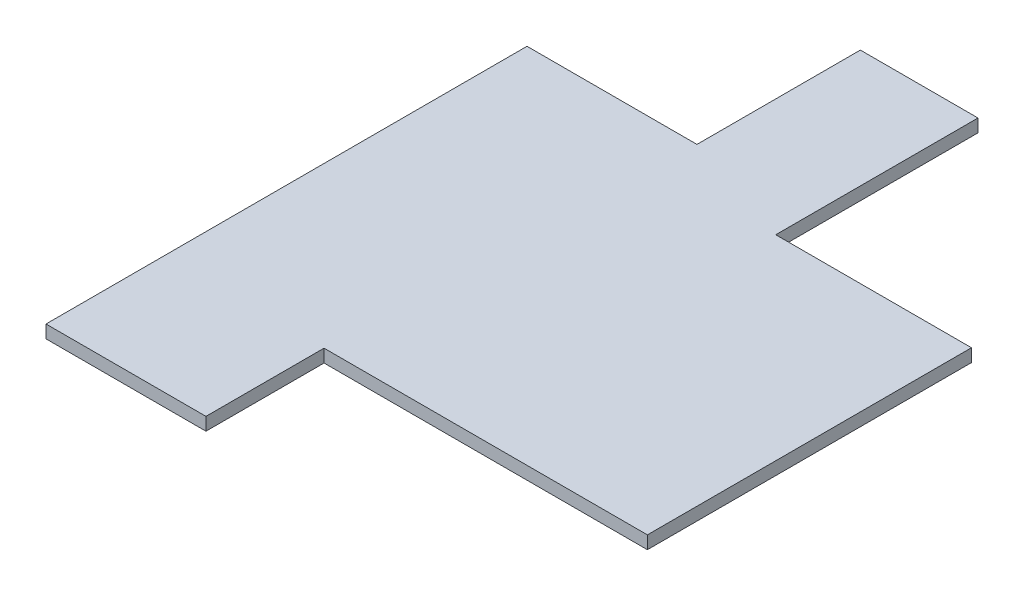
ISO-10303-21;
HEADER;
FILE_DESCRIPTION(('STEP AP214'),'2;1');
FILE_NAME('part.step','',(''),(''),'','','');
FILE_SCHEMA(('AUTOMOTIVE_DESIGN { 1 0 10303 214 1 1 1 1 }'));
ENDSEC;
DATA;
#1=APPLICATION_CONTEXT('core data for automotive mechanical design processes');
#2=APPLICATION_PROTOCOL_DEFINITION('international standard','automotive_design',2000,#1);
#3=PRODUCT_CONTEXT('',#1,'mechanical');
#4=PRODUCT('Part','Part','',(#3));
#5=PRODUCT_RELATED_PRODUCT_CATEGORY('part','',(#4));
#6=PRODUCT_DEFINITION_FORMATION('','',#4);
#7=PRODUCT_DEFINITION_CONTEXT('part definition',#1,'design');
#8=PRODUCT_DEFINITION('design','',#6,#7);
#9=PRODUCT_DEFINITION_SHAPE('','',#8);
#10=(LENGTH_UNIT() NAMED_UNIT(*) SI_UNIT(.MILLI.,.METRE.));
#11=(NAMED_UNIT(*) PLANE_ANGLE_UNIT() SI_UNIT($,.RADIAN.));
#12=(NAMED_UNIT(*) SI_UNIT($,.STERADIAN.) SOLID_ANGLE_UNIT());
#13=UNCERTAINTY_MEASURE_WITH_UNIT(LENGTH_MEASURE(1.E-05),#10,'distance_accuracy_value','');
#14=(GEOMETRIC_REPRESENTATION_CONTEXT(3) GLOBAL_UNCERTAINTY_ASSIGNED_CONTEXT((#13)) GLOBAL_UNIT_ASSIGNED_CONTEXT((#10,
#11,#12)) REPRESENTATION_CONTEXT('',''));
#15=CARTESIAN_POINT('',(0.,0.,0.));
#16=DIRECTION('',(0.,0.,1.));
#17=DIRECTION('',(1.,0.,0.));
#18=AXIS2_PLACEMENT_3D('',#15,#16,#17);
#19=CARTESIAN_POINT('',(-15.,0.4,20.));
#20=DIRECTION('',(1.,0.,0.));
#21=DIRECTION('',(0.,0.,-1.));
#22=AXIS2_PLACEMENT_3D('',#19,#20,#21);
#23=PLANE('',#22);
#24=DIRECTION('',(0.,0.,1.));
#25=VECTOR('',#24,1.);
#26=CARTESIAN_POINT('',(-15.,-0.4,20.));
#27=LINE('',#26,#25);
#28=CARTESIAN_POINT('',(-15.,-0.4,-9.85814327363708));
#29=VERTEX_POINT('',#28);
#30=CARTESIAN_POINT('',(-15.,-0.4,20.));
#31=VERTEX_POINT('',#30);
#32=EDGE_CURVE('E144',#29,#31,#27,.T.);
#33=ORIENTED_EDGE('',*,*,#32,.T.);
#34=DIRECTION('',(0.,-1.,0.));
#35=VECTOR('',#34,1.);
#36=CARTESIAN_POINT('',(-15.,0.4,20.));
#37=LINE('',#36,#35);
#38=CARTESIAN_POINT('',(-15.,0.4,20.));
#39=VERTEX_POINT('',#38);
#40=EDGE_CURVE('E11',#39,#31,#37,.T.);
#41=ORIENTED_EDGE('',*,*,#40,.F.);
#42=DIRECTION('',(0.,0.,1.));
#43=VECTOR('',#42,1.);
#44=CARTESIAN_POINT('',(-15.,0.4,20.));
#45=LINE('',#44,#43);
#46=CARTESIAN_POINT('',(-15.,0.4,-9.85814327363708));
#47=VERTEX_POINT('',#46);
#48=EDGE_CURVE('E162',#47,#39,#45,.T.);
#49=ORIENTED_EDGE('',*,*,#48,.F.);
#50=DIRECTION('',(0.,-1.,0.));
#51=VECTOR('',#50,1.);
#52=CARTESIAN_POINT('',(-15.,0.4,-9.85814327363708));
#53=LINE('',#52,#51);
#54=EDGE_CURVE('E140',#47,#29,#53,.T.);
#55=ORIENTED_EDGE('',*,*,#54,.T.);
#56=EDGE_LOOP('',(#33,#41,#49,#55));
#57=FACE_BOUND('',#56,.T.);
#58=ADVANCED_FACE('F36',(#57),#23,.F.);
#59=CARTESIAN_POINT('',(-15.,0.4,20.));
#60=DIRECTION('',(0.,0.,-1.));
#61=DIRECTION('',(-1.,0.,0.));
#62=AXIS2_PLACEMENT_3D('',#59,#60,#61);
#63=PLANE('',#62);
#64=DIRECTION('',(1.,0.,0.));
#65=VECTOR('',#64,1.);
#66=CARTESIAN_POINT('',(-15.,-0.4,20.));
#67=LINE('',#66,#65);
#68=CARTESIAN_POINT('',(-5.07095815207298,-0.4,20.));
#69=VERTEX_POINT('',#68);
#70=EDGE_CURVE('E147',#31,#69,#67,.T.);
#71=ORIENTED_EDGE('',*,*,#70,.T.);
#72=DIRECTION('',(0.,-1.,0.));
#73=VECTOR('',#72,1.);
#74=CARTESIAN_POINT('',(-5.07095815207298,0.4,20.));
#75=LINE('',#74,#73);
#76=CARTESIAN_POINT('',(-5.07095815207298,0.4,20.));
#77=VERTEX_POINT('',#76);
#78=EDGE_CURVE('E44',#77,#69,#75,.T.);
#79=ORIENTED_EDGE('',*,*,#78,.F.);
#80=DIRECTION('',(1.,0.,0.));
#81=VECTOR('',#80,1.);
#82=CARTESIAN_POINT('',(-15.,0.4,20.));
#83=LINE('',#82,#81);
#84=EDGE_CURVE('E101',#39,#77,#83,.T.);
#85=ORIENTED_EDGE('',*,*,#84,.F.);
#86=ORIENTED_EDGE('',*,*,#40,.T.);
#87=EDGE_LOOP('',(#71,#79,#85,#86));
#88=FACE_BOUND('',#87,.T.);
#89=ADVANCED_FACE('F211',(#88),#63,.F.);
#90=CARTESIAN_POINT('',(-5.07095815207298,0.4,20.));
#91=DIRECTION('',(-1.,0.,0.));
#92=DIRECTION('',(0.,0.,1.));
#93=AXIS2_PLACEMENT_3D('',#90,#91,#92);
#94=PLANE('',#93);
#95=DIRECTION('',(0.,0.,-1.));
#96=VECTOR('',#95,1.);
#97=CARTESIAN_POINT('',(-5.07095815207298,-0.4,20.));
#98=LINE('',#97,#96);
#99=CARTESIAN_POINT('',(-5.07095815207298,-0.4,12.6697448093642));
#100=VERTEX_POINT('',#99);
#101=EDGE_CURVE('E149',#69,#100,#98,.T.);
#102=ORIENTED_EDGE('',*,*,#101,.T.);
#103=DIRECTION('',(0.,-1.,0.));
#104=VECTOR('',#103,1.);
#105=CARTESIAN_POINT('',(-5.07095815207298,0.4,12.6697448093642));
#106=LINE('',#105,#104);
#107=CARTESIAN_POINT('',(-5.07095815207298,0.4,12.6697448093642));
#108=VERTEX_POINT('',#107);
#109=EDGE_CURVE('E175',#108,#100,#106,.T.);
#110=ORIENTED_EDGE('',*,*,#109,.F.);
#111=DIRECTION('',(0.,0.,-1.));
#112=VECTOR('',#111,1.);
#113=CARTESIAN_POINT('',(-5.07095815207298,0.4,20.));
#114=LINE('',#113,#112);
#115=EDGE_CURVE('E183',#77,#108,#114,.T.);
#116=ORIENTED_EDGE('',*,*,#115,.F.);
#117=ORIENTED_EDGE('',*,*,#78,.T.);
#118=EDGE_LOOP('',(#102,#110,#116,#117));
#119=FACE_BOUND('',#118,.T.);
#120=ADVANCED_FACE('F181',(#119),#94,.F.);
#121=CARTESIAN_POINT('',(-5.07095815207298,0.4,12.6697448093642));
#122=DIRECTION('',(0.,0.,-1.));
#123=DIRECTION('',(-1.,0.,0.));
#124=AXIS2_PLACEMENT_3D('',#121,#122,#123);
#125=PLANE('',#124);
#126=DIRECTION('',(1.,0.,0.));
#127=VECTOR('',#126,1.);
#128=CARTESIAN_POINT('',(-5.07095815207298,-0.4,12.6697448093642));
#129=LINE('',#128,#127);
#130=CARTESIAN_POINT('',(15.,-0.4,12.6697448093642));
#131=VERTEX_POINT('',#130);
#132=EDGE_CURVE('E151',#100,#131,#129,.T.);
#133=ORIENTED_EDGE('',*,*,#132,.T.);
#134=DIRECTION('',(0.,-1.,0.));
#135=VECTOR('',#134,1.);
#136=CARTESIAN_POINT('',(15.,0.4,12.6697448093642));
#137=LINE('',#136,#135);
#138=CARTESIAN_POINT('',(15.,0.4,12.6697448093642));
#139=VERTEX_POINT('',#138);
#140=EDGE_CURVE('E172',#139,#131,#137,.T.);
#141=ORIENTED_EDGE('',*,*,#140,.F.);
#142=DIRECTION('',(1.,0.,0.));
#143=VECTOR('',#142,1.);
#144=CARTESIAN_POINT('',(-5.07095815207298,0.4,12.6697448093642));
#145=LINE('',#144,#143);
#146=EDGE_CURVE('E201',#108,#139,#145,.T.);
#147=ORIENTED_EDGE('',*,*,#146,.F.);
#148=ORIENTED_EDGE('',*,*,#109,.T.);
#149=EDGE_LOOP('',(#133,#141,#147,#148));
#150=FACE_BOUND('',#149,.T.);
#151=ADVANCED_FACE('F192',(#150),#125,.F.);
#152=CARTESIAN_POINT('',(15.,0.4,12.6697448093642));
#153=DIRECTION('',(-1.,0.,0.));
#154=DIRECTION('',(0.,0.,1.));
#155=AXIS2_PLACEMENT_3D('',#152,#153,#154);
#156=PLANE('',#155);
#157=DIRECTION('',(0.,0.,-1.));
#158=VECTOR('',#157,1.);
#159=CARTESIAN_POINT('',(15.,-0.4,12.6697448093642));
#160=LINE('',#159,#158);
#161=CARTESIAN_POINT('',(15.,-0.4,-7.44690142989077));
#162=VERTEX_POINT('',#161);
#163=EDGE_CURVE('E153',#131,#162,#160,.T.);
#164=ORIENTED_EDGE('',*,*,#163,.T.);
#165=DIRECTION('',(0.,-1.,0.));
#166=VECTOR('',#165,1.);
#167=CARTESIAN_POINT('',(15.,0.4,-7.44690142989077));
#168=LINE('',#167,#166);
#169=CARTESIAN_POINT('',(15.,0.4,-7.44690142989077));
#170=VERTEX_POINT('',#169);
#171=EDGE_CURVE('E169',#170,#162,#168,.T.);
#172=ORIENTED_EDGE('',*,*,#171,.F.);
#173=DIRECTION('',(0.,0.,-1.));
#174=VECTOR('',#173,1.);
#175=CARTESIAN_POINT('',(15.,0.4,12.6697448093642));
#176=LINE('',#175,#174);
#177=EDGE_CURVE('E198',#139,#170,#176,.T.);
#178=ORIENTED_EDGE('',*,*,#177,.F.);
#179=ORIENTED_EDGE('',*,*,#140,.T.);
#180=EDGE_LOOP('',(#164,#172,#178,#179));
#181=FACE_BOUND('',#180,.T.);
#182=ADVANCED_FACE('F196',(#181),#156,.F.);
#183=CARTESIAN_POINT('',(15.,0.4,-7.44690142989077));
#184=DIRECTION('',(0.,0.,1.));
#185=DIRECTION('',(1.,0.,0.));
#186=AXIS2_PLACEMENT_3D('',#183,#184,#185);
#187=PLANE('',#186);
#188=DIRECTION('',(-1.,0.,0.));
#189=VECTOR('',#188,1.);
#190=CARTESIAN_POINT('',(15.,-0.4,-7.44690142989077));
#191=LINE('',#190,#189);
#192=CARTESIAN_POINT('',(2.85169362023634,-0.4,-7.44690142989077));
#193=VERTEX_POINT('',#192);
#194=EDGE_CURVE('E155',#162,#193,#191,.T.);
#195=ORIENTED_EDGE('',*,*,#194,.T.);
#196=DIRECTION('',(0.,-1.,0.));
#197=VECTOR('',#196,1.);
#198=CARTESIAN_POINT('',(2.85169362023634,0.4,-7.44690142989077));
#199=LINE('',#198,#197);
#200=CARTESIAN_POINT('',(2.85169362023634,0.4,-7.44690142989077));
#201=VERTEX_POINT('',#200);
#202=EDGE_CURVE('E166',#201,#193,#199,.T.);
#203=ORIENTED_EDGE('',*,*,#202,.F.);
#204=DIRECTION('',(-1.,0.,0.));
#205=VECTOR('',#204,1.);
#206=CARTESIAN_POINT('',(15.,0.4,-7.44690142989077));
#207=LINE('',#206,#205);
#208=EDGE_CURVE('E200',#170,#201,#207,.T.);
#209=ORIENTED_EDGE('',*,*,#208,.F.);
#210=ORIENTED_EDGE('',*,*,#171,.T.);
#211=EDGE_LOOP('',(#195,#203,#209,#210));
#212=FACE_BOUND('',#211,.T.);
#213=ADVANCED_FACE('F223',(#212),#187,.F.);
#214=CARTESIAN_POINT('',(2.85169362023634,0.4,-7.44690142989077));
#215=DIRECTION('',(-1.,0.,0.));
#216=DIRECTION('',(0.,0.,1.));
#217=AXIS2_PLACEMENT_3D('',#214,#215,#216);
#218=PLANE('',#217);
#219=DIRECTION('',(0.,0.,-1.));
#220=VECTOR('',#219,1.);
#221=CARTESIAN_POINT('',(2.85169362023634,-0.4,-7.44690142989077));
#222=LINE('',#221,#220);
#223=CARTESIAN_POINT('',(2.85169362023634,-0.4,-20.));
#224=VERTEX_POINT('',#223);
#225=EDGE_CURVE('E157',#193,#224,#222,.T.);
#226=ORIENTED_EDGE('',*,*,#225,.T.);
#227=DIRECTION('',(0.,-1.,0.));
#228=VECTOR('',#227,1.);
#229=CARTESIAN_POINT('',(2.85169362023634,0.4,-20.));
#230=LINE('',#229,#228);
#231=CARTESIAN_POINT('',(2.85169362023634,0.4,-20.));
#232=VERTEX_POINT('',#231);
#233=EDGE_CURVE('E135',#232,#224,#230,.T.);
#234=ORIENTED_EDGE('',*,*,#233,.F.);
#235=DIRECTION('',(0.,0.,-1.));
#236=VECTOR('',#235,1.);
#237=CARTESIAN_POINT('',(2.85169362023634,0.4,-7.44690142989077));
#238=LINE('',#237,#236);
#239=EDGE_CURVE('E126',#201,#232,#238,.T.);
#240=ORIENTED_EDGE('',*,*,#239,.F.);
#241=ORIENTED_EDGE('',*,*,#202,.T.);
#242=EDGE_LOOP('',(#226,#234,#240,#241));
#243=FACE_BOUND('',#242,.T.);
#244=ADVANCED_FACE('F226',(#243),#218,.F.);
#245=CARTESIAN_POINT('',(-4.45092453510965,0.4,-20.));
#246=DIRECTION('',(0.,0.,1.));
#247=DIRECTION('',(1.,0.,0.));
#248=AXIS2_PLACEMENT_3D('',#245,#246,#247);
#249=PLANE('',#248);
#250=DIRECTION('',(-1.,0.,0.));
#251=VECTOR('',#250,1.);
#252=CARTESIAN_POINT('',(-4.45092453510965,-0.4,-20.));
#253=LINE('',#252,#251);
#254=CARTESIAN_POINT('',(-4.45092453510965,-0.4,-20.));
#255=VERTEX_POINT('',#254);
#256=EDGE_CURVE('E134',#224,#255,#253,.T.);
#257=ORIENTED_EDGE('',*,*,#256,.T.);
#258=DIRECTION('',(0.,-1.,0.));
#259=VECTOR('',#258,1.);
#260=CARTESIAN_POINT('',(-4.45092453510965,0.4,-20.));
#261=LINE('',#260,#259);
#262=CARTESIAN_POINT('',(-4.45092453510965,0.4,-20.));
#263=VERTEX_POINT('',#262);
#264=EDGE_CURVE('E131',#263,#255,#261,.T.);
#265=ORIENTED_EDGE('',*,*,#264,.F.);
#266=DIRECTION('',(-1.,0.,0.));
#267=VECTOR('',#266,1.);
#268=CARTESIAN_POINT('',(-4.45092453510965,0.4,-20.));
#269=LINE('',#268,#267);
#270=EDGE_CURVE('E120',#232,#263,#269,.T.);
#271=ORIENTED_EDGE('',*,*,#270,.F.);
#272=ORIENTED_EDGE('',*,*,#233,.T.);
#273=EDGE_LOOP('',(#257,#265,#271,#272));
#274=FACE_BOUND('',#273,.T.);
#275=ADVANCED_FACE('F132',(#274),#249,.F.);
#276=CARTESIAN_POINT('',(-4.45092453510965,0.4,-9.85814327363708));
#277=DIRECTION('',(1.,0.,0.));
#278=DIRECTION('',(0.,0.,-1.));
#279=AXIS2_PLACEMENT_3D('',#276,#277,#278);
#280=PLANE('',#279);
#281=DIRECTION('',(0.,0.,1.));
#282=VECTOR('',#281,1.);
#283=CARTESIAN_POINT('',(-4.45092453510965,-0.4,-9.85814327363708));
#284=LINE('',#283,#282);
#285=CARTESIAN_POINT('',(-4.45092453510965,-0.4,-9.85814327363708));
#286=VERTEX_POINT('',#285);
#287=EDGE_CURVE('E87',#255,#286,#284,.T.);
#288=ORIENTED_EDGE('',*,*,#287,.T.);
#289=DIRECTION('',(0.,-1.,0.));
#290=VECTOR('',#289,1.);
#291=CARTESIAN_POINT('',(-4.45092453510965,0.4,-9.85814327363708));
#292=LINE('',#291,#290);
#293=CARTESIAN_POINT('',(-4.45092453510965,0.4,-9.85814327363708));
#294=VERTEX_POINT('',#293);
#295=EDGE_CURVE('E136',#294,#286,#292,.T.);
#296=ORIENTED_EDGE('',*,*,#295,.F.);
#297=DIRECTION('',(0.,0.,1.));
#298=VECTOR('',#297,1.);
#299=CARTESIAN_POINT('',(-4.45092453510965,0.4,-9.85814327363708));
#300=LINE('',#299,#298);
#301=EDGE_CURVE('E124',#263,#294,#300,.T.);
#302=ORIENTED_EDGE('',*,*,#301,.F.);
#303=ORIENTED_EDGE('',*,*,#264,.T.);
#304=EDGE_LOOP('',(#288,#296,#302,#303));
#305=FACE_BOUND('',#304,.T.);
#306=ADVANCED_FACE('F138',(#305),#280,.F.);
#307=CARTESIAN_POINT('',(-15.,0.4,-9.85814327363708));
#308=DIRECTION('',(0.,0.,1.));
#309=DIRECTION('',(1.,0.,0.));
#310=AXIS2_PLACEMENT_3D('',#307,#308,#309);
#311=PLANE('',#310);
#312=DIRECTION('',(-1.,0.,0.));
#313=VECTOR('',#312,1.);
#314=CARTESIAN_POINT('',(-15.,-0.4,-9.85814327363708));
#315=LINE('',#314,#313);
#316=EDGE_CURVE('E93',#286,#29,#315,.T.);
#317=ORIENTED_EDGE('',*,*,#316,.T.);
#318=ORIENTED_EDGE('',*,*,#54,.F.);
#319=DIRECTION('',(-1.,0.,0.));
#320=VECTOR('',#319,1.);
#321=CARTESIAN_POINT('',(-15.,0.4,-9.85814327363708));
#322=LINE('',#321,#320);
#323=EDGE_CURVE('E52',#294,#47,#322,.T.);
#324=ORIENTED_EDGE('',*,*,#323,.F.);
#325=ORIENTED_EDGE('',*,*,#295,.T.);
#326=EDGE_LOOP('',(#317,#318,#324,#325));
#327=FACE_BOUND('',#326,.T.);
#328=ADVANCED_FACE('F235',(#327),#311,.F.);
#329=CARTESIAN_POINT('',(0.,0.4,0.));
#330=DIRECTION('',(0.,-1.,0.));
#331=DIRECTION('',(0.,0.,-1.));
#332=AXIS2_PLACEMENT_3D('',#329,#330,#331);
#333=PLANE('',#332);
#334=ORIENTED_EDGE('',*,*,#48,.T.);
#335=ORIENTED_EDGE('',*,*,#84,.T.);
#336=ORIENTED_EDGE('',*,*,#115,.T.);
#337=ORIENTED_EDGE('',*,*,#146,.T.);
#338=ORIENTED_EDGE('',*,*,#177,.T.);
#339=ORIENTED_EDGE('',*,*,#208,.T.);
#340=ORIENTED_EDGE('',*,*,#239,.T.);
#341=ORIENTED_EDGE('',*,*,#270,.T.);
#342=ORIENTED_EDGE('',*,*,#301,.T.);
#343=ORIENTED_EDGE('',*,*,#323,.T.);
#344=EDGE_LOOP('',(#334,#335,#336,#337,#338,#339,#340,#341,#342,#343));
#345=FACE_BOUND('',#344,.T.);
#346=ADVANCED_FACE('F122',(#345),#333,.F.);
#347=CARTESIAN_POINT('',(0.,-0.4,0.));
#348=DIRECTION('',(0.,-1.,0.));
#349=DIRECTION('',(0.,0.,-1.));
#350=AXIS2_PLACEMENT_3D('',#347,#348,#349);
#351=PLANE('',#350);
#352=ORIENTED_EDGE('',*,*,#32,.F.);
#353=ORIENTED_EDGE('',*,*,#316,.F.);
#354=ORIENTED_EDGE('',*,*,#287,.F.);
#355=ORIENTED_EDGE('',*,*,#256,.F.);
#356=ORIENTED_EDGE('',*,*,#225,.F.);
#357=ORIENTED_EDGE('',*,*,#194,.F.);
#358=ORIENTED_EDGE('',*,*,#163,.F.);
#359=ORIENTED_EDGE('',*,*,#132,.F.);
#360=ORIENTED_EDGE('',*,*,#101,.F.);
#361=ORIENTED_EDGE('',*,*,#70,.F.);
#362=EDGE_LOOP('',(#352,#353,#354,#355,#356,#357,#358,#359,#360,#361));
#363=FACE_BOUND('',#362,.T.);
#364=ADVANCED_FACE('F187',(#363),#351,.T.);
#365=CLOSED_SHELL('',(#58,#89,#120,#151,#182,#213,#244,#275,#306,#328,#346,#364));
#366=MANIFOLD_SOLID_BREP('B2',#365);
#367=ADVANCED_BREP_SHAPE_REPRESENTATION('',(#18,#366),#14);
#368=SHAPE_DEFINITION_REPRESENTATION(#9,#367);
ENDSEC;
END-ISO-10303-21;
